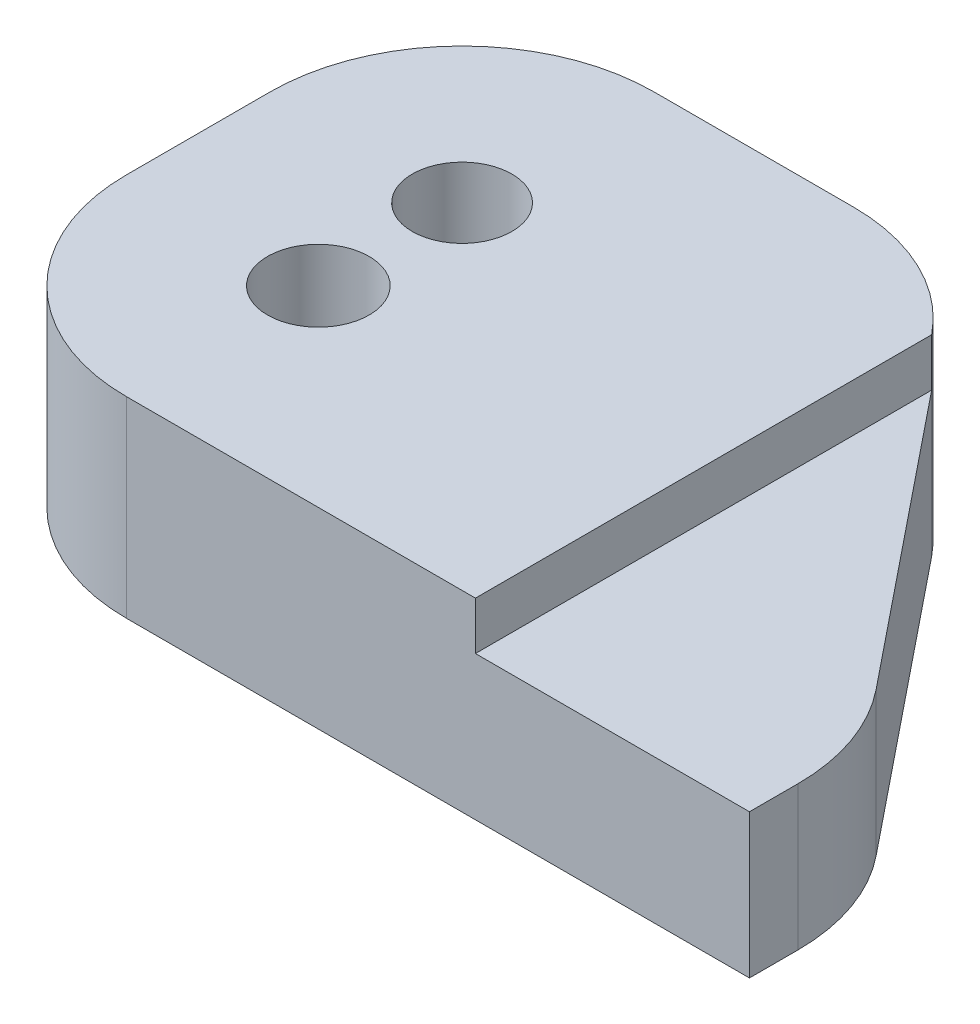
ISO-10303-21;
HEADER;
FILE_DESCRIPTION(('STEP AP214'),'2;1');
FILE_NAME('part.step','',(''),(''),'','','');
FILE_SCHEMA(('AUTOMOTIVE_DESIGN { 1 0 10303 214 1 1 1 1 }'));
ENDSEC;
DATA;
#1=APPLICATION_CONTEXT('core data for automotive mechanical design processes');
#2=APPLICATION_PROTOCOL_DEFINITION('international standard','automotive_design',2000,#1);
#3=PRODUCT_CONTEXT('',#1,'mechanical');
#4=PRODUCT('Part','Part','',(#3));
#5=PRODUCT_RELATED_PRODUCT_CATEGORY('part','',(#4));
#6=PRODUCT_DEFINITION_FORMATION('','',#4);
#7=PRODUCT_DEFINITION_CONTEXT('part definition',#1,'design');
#8=PRODUCT_DEFINITION('design','',#6,#7);
#9=PRODUCT_DEFINITION_SHAPE('','',#8);
#10=(LENGTH_UNIT() NAMED_UNIT(*) SI_UNIT(.MILLI.,.METRE.));
#11=(NAMED_UNIT(*) PLANE_ANGLE_UNIT() SI_UNIT($,.RADIAN.));
#12=(NAMED_UNIT(*) SI_UNIT($,.STERADIAN.) SOLID_ANGLE_UNIT());
#13=UNCERTAINTY_MEASURE_WITH_UNIT(LENGTH_MEASURE(1.E-05),#10,'distance_accuracy_value','');
#14=(GEOMETRIC_REPRESENTATION_CONTEXT(3) GLOBAL_UNCERTAINTY_ASSIGNED_CONTEXT((#13)) GLOBAL_UNIT_ASSIGNED_CONTEXT((#10,
#11,#12)) REPRESENTATION_CONTEXT('',''));
#15=CARTESIAN_POINT('',(0.,0.,0.));
#16=DIRECTION('',(0.,0.,1.));
#17=DIRECTION('',(1.,0.,0.));
#18=AXIS2_PLACEMENT_3D('',#15,#16,#17);
#19=CARTESIAN_POINT('',(0.,19.05,0.));
#20=DIRECTION('',(0.,-1.,0.));
#21=DIRECTION('',(0.,0.,-1.));
#22=AXIS2_PLACEMENT_3D('',#19,#20,#21);
#23=PLANE('',#22);
#24=DIRECTION('',(0.,0.,-1.));
#25=VECTOR('',#24,1.);
#26=CARTESIAN_POINT('',(17.6653326935779,19.05,-25.4528034593956));
#27=LINE('',#26,#25);
#28=CARTESIAN_POINT('',(17.6653326935779,19.05,34.907603773285));
#29=VERTEX_POINT('',#28);
#30=CARTESIAN_POINT('',(17.6653326935779,19.05,-25.4528034593956));
#31=VERTEX_POINT('',#30);
#32=EDGE_CURVE('E56',#29,#31,#27,.T.);
#33=ORIENTED_EDGE('',*,*,#32,.F.);
#34=DIRECTION('',(1.,0.,0.));
#35=VECTOR('',#34,1.);
#36=CARTESIAN_POINT('',(-53.9178925812483,19.05,34.907603773285));
#37=LINE('',#36,#35);
#38=CARTESIAN_POINT('',(53.9178925812483,19.05,34.907603773285));
#39=VERTEX_POINT('',#38);
#40=EDGE_CURVE('E217',#29,#39,#37,.T.);
#41=ORIENTED_EDGE('',*,*,#40,.T.);
#42=DIRECTION('',(0.,0.,-1.));
#43=VECTOR('',#42,1.);
#44=CARTESIAN_POINT('',(53.9178925812483,19.05,34.907603773285));
#45=LINE('',#44,#43);
#46=CARTESIAN_POINT('',(53.9178925812483,19.05,28.4650504511518));
#47=VERTEX_POINT('',#46);
#48=EDGE_CURVE('E221',#39,#47,#45,.T.);
#49=ORIENTED_EDGE('',*,*,#48,.T.);
#50=CARTESIAN_POINT('',(28.5178925812483,19.05,28.4650504511518));
#51=DIRECTION('',(0.,-1.,0.));
#52=DIRECTION('',(0.,0.,-1.));
#53=AXIS2_PLACEMENT_3D('',#50,#51,#52);
#54=CIRCLE('',#53,25.4);
#55=CARTESIAN_POINT('',(48.2893519854011,19.05,12.5198507650412));
#56=VERTEX_POINT('',#55);
#57=EDGE_CURVE('E62',#47,#56,#54,.F.);
#58=ORIENTED_EDGE('',*,*,#57,.T.);
#59=DIRECTION('',(-0.627763767169705,0.,-0.778403913549322));
#60=VECTOR('',#59,1.);
#61=CARTESIAN_POINT('',(10.0402668896038,19.05,-34.907603773285));
#62=LINE('',#61,#60);
#63=EDGE_CURVE('E198',#56,#31,#62,.T.);
#64=ORIENTED_EDGE('',*,*,#63,.T.);
#65=EDGE_LOOP('',(#33,#41,#49,#58,#64));
#66=FACE_BOUND('',#65,.T.);
#67=ADVANCED_FACE('F41',(#66),#23,.F.);
#68=CARTESIAN_POINT('',(-53.9178925812483,19.05,34.907603773285));
#69=DIRECTION('',(1.,0.,0.));
#70=DIRECTION('',(0.,0.,-1.));
#71=AXIS2_PLACEMENT_3D('',#68,#69,#70);
#72=PLANE('',#71);
#73=DIRECTION('',(0.,0.,1.));
#74=VECTOR('',#73,1.);
#75=CARTESIAN_POINT('',(-53.9178925812483,0.,34.907603773285));
#76=LINE('',#75,#74);
#77=CARTESIAN_POINT('',(-53.9178925812483,0.,-9.50760377328504));
#78=VERTEX_POINT('',#77);
#79=CARTESIAN_POINT('',(-53.9178925812483,0.,9.50760377328504));
#80=VERTEX_POINT('',#79);
#81=EDGE_CURVE('E215',#78,#80,#76,.T.);
#82=ORIENTED_EDGE('',*,*,#81,.T.);
#83=DIRECTION('',(0.,-1.,0.));
#84=VECTOR('',#83,1.);
#85=CARTESIAN_POINT('',(-53.9178925812483,19.05,9.50760377328504));
#86=LINE('',#85,#84);
#87=CARTESIAN_POINT('',(-53.9178925812483,25.4,9.50760377328504));
#88=VERTEX_POINT('',#87);
#89=EDGE_CURVE('E130',#80,#88,#86,.F.);
#90=ORIENTED_EDGE('',*,*,#89,.T.);
#91=DIRECTION('',(0.,0.,1.));
#92=VECTOR('',#91,1.);
#93=CARTESIAN_POINT('',(-53.9178925812483,25.4,-9.50760377328504));
#94=LINE('',#93,#92);
#95=CARTESIAN_POINT('',(-53.9178925812483,25.4,-9.50760377328504));
#96=VERTEX_POINT('',#95);
#97=EDGE_CURVE('E134',#96,#88,#94,.T.);
#98=ORIENTED_EDGE('',*,*,#97,.F.);
#99=DIRECTION('',(0.,-1.,0.));
#100=VECTOR('',#99,1.);
#101=CARTESIAN_POINT('',(-53.9178925812483,19.05,-9.50760377328504));
#102=LINE('',#101,#100);
#103=EDGE_CURVE('E120',#96,#78,#102,.T.);
#104=ORIENTED_EDGE('',*,*,#103,.T.);
#105=EDGE_LOOP('',(#82,#90,#98,#104));
#106=FACE_BOUND('',#105,.T.);
#107=ADVANCED_FACE('F135',(#106),#72,.F.);
#108=CARTESIAN_POINT('',(-53.9178925812483,19.05,34.907603773285));
#109=DIRECTION('',(0.,0.,-1.));
#110=DIRECTION('',(-1.,0.,0.));
#111=AXIS2_PLACEMENT_3D('',#108,#109,#110);
#112=PLANE('',#111);
#113=ORIENTED_EDGE('',*,*,#40,.F.);
#114=DIRECTION('',(0.,-1.,0.));
#115=VECTOR('',#114,1.);
#116=CARTESIAN_POINT('',(17.6653326935779,25.4,34.907603773285));
#117=LINE('',#116,#115);
#118=CARTESIAN_POINT('',(17.6653326935779,25.4,34.907603773285));
#119=VERTEX_POINT('',#118);
#120=EDGE_CURVE('E212',#119,#29,#117,.T.);
#121=ORIENTED_EDGE('',*,*,#120,.F.);
#122=DIRECTION('',(1.,0.,0.));
#123=VECTOR('',#122,1.);
#124=CARTESIAN_POINT('',(-28.5178925812483,25.4,34.907603773285));
#125=LINE('',#124,#123);
#126=CARTESIAN_POINT('',(-28.5178925812483,25.4,34.907603773285));
#127=VERTEX_POINT('',#126);
#128=EDGE_CURVE('E166',#127,#119,#125,.T.);
#129=ORIENTED_EDGE('',*,*,#128,.F.);
#130=DIRECTION('',(0.,-1.,0.));
#131=VECTOR('',#130,1.);
#132=CARTESIAN_POINT('',(-28.5178925812483,19.05,34.907603773285));
#133=LINE('',#132,#131);
#134=CARTESIAN_POINT('',(-28.5178925812483,0.,34.907603773285));
#135=VERTEX_POINT('',#134);
#136=EDGE_CURVE('E237',#127,#135,#133,.T.);
#137=ORIENTED_EDGE('',*,*,#136,.T.);
#138=DIRECTION('',(1.,0.,0.));
#139=VECTOR('',#138,1.);
#140=CARTESIAN_POINT('',(-53.9178925812483,0.,34.907603773285));
#141=LINE('',#140,#139);
#142=CARTESIAN_POINT('',(53.9178925812483,0.,34.907603773285));
#143=VERTEX_POINT('',#142);
#144=EDGE_CURVE('E227',#135,#143,#141,.T.);
#145=ORIENTED_EDGE('',*,*,#144,.T.);
#146=DIRECTION('',(0.,-1.,0.));
#147=VECTOR('',#146,1.);
#148=CARTESIAN_POINT('',(53.9178925812483,19.05,34.907603773285));
#149=LINE('',#148,#147);
#150=EDGE_CURVE('E225',#39,#143,#149,.T.);
#151=ORIENTED_EDGE('',*,*,#150,.F.);
#152=EDGE_LOOP('',(#113,#121,#129,#137,#145,#151));
#153=FACE_BOUND('',#152,.T.);
#154=ADVANCED_FACE('F253',(#153),#112,.F.);
#155=CARTESIAN_POINT('',(53.9178925812483,19.05,34.907603773285));
#156=DIRECTION('',(-1.,0.,0.));
#157=DIRECTION('',(0.,0.,1.));
#158=AXIS2_PLACEMENT_3D('',#155,#156,#157);
#159=PLANE('',#158);
#160=DIRECTION('',(0.,0.,-1.));
#161=VECTOR('',#160,1.);
#162=CARTESIAN_POINT('',(53.9178925812483,0.,34.907603773285));
#163=LINE('',#162,#161);
#164=CARTESIAN_POINT('',(53.9178925812483,0.,28.4650504511518));
#165=VERTEX_POINT('',#164);
#166=EDGE_CURVE('E229',#143,#165,#163,.T.);
#167=ORIENTED_EDGE('',*,*,#166,.T.);
#168=DIRECTION('',(0.,-1.,0.));
#169=VECTOR('',#168,1.);
#170=CARTESIAN_POINT('',(53.9178925812483,19.05,28.4650504511518));
#171=LINE('',#170,#169);
#172=EDGE_CURVE('E12',#165,#47,#171,.F.);
#173=ORIENTED_EDGE('',*,*,#172,.T.);
#174=ORIENTED_EDGE('',*,*,#48,.F.);
#175=ORIENTED_EDGE('',*,*,#150,.T.);
#176=EDGE_LOOP('',(#167,#173,#174,#175));
#177=FACE_BOUND('',#176,.T.);
#178=ADVANCED_FACE('F261',(#177),#159,.F.);
#179=CARTESIAN_POINT('',(10.0402668896038,19.05,-34.907603773285));
#180=DIRECTION('',(-0.778403913549322,0.,0.627763767169705));
#181=DIRECTION('',(0.627763767169705,0.,0.778403913549322));
#182=AXIS2_PLACEMENT_3D('',#179,#180,#181);
#183=PLANE('',#182);
#184=DIRECTION('',(-0.627763767169705,0.,-0.778403913549322));
#185=VECTOR('',#184,1.);
#186=CARTESIAN_POINT('',(10.0402668896038,0.,-34.907603773285));
#187=LINE('',#186,#185);
#188=CARTESIAN_POINT('',(48.2893519854011,0.,12.5198507650412));
#189=VERTEX_POINT('',#188);
#190=CARTESIAN_POINT('',(17.6653326935779,0.,-25.4528034593956));
#191=VERTEX_POINT('',#190);
#192=EDGE_CURVE('E201',#189,#191,#187,.T.);
#193=ORIENTED_EDGE('',*,*,#192,.T.);
#194=DIRECTION('',(0.,-1.,0.));
#195=VECTOR('',#194,1.);
#196=CARTESIAN_POINT('',(17.6653326935779,19.05,-25.4528034593956));
#197=LINE('',#196,#195);
#198=EDGE_CURVE('E49',#191,#31,#197,.F.);
#199=ORIENTED_EDGE('',*,*,#198,.T.);
#200=ORIENTED_EDGE('',*,*,#63,.F.);
#201=DIRECTION('',(0.,-1.,0.));
#202=VECTOR('',#201,1.);
#203=CARTESIAN_POINT('',(48.2893519854011,19.05,12.5198507650412));
#204=LINE('',#203,#202);
#205=EDGE_CURVE('E191',#56,#189,#204,.T.);
#206=ORIENTED_EDGE('',*,*,#205,.T.);
#207=EDGE_LOOP('',(#193,#199,#200,#206));
#208=FACE_BOUND('',#207,.T.);
#209=ADVANCED_FACE('F197',(#208),#183,.F.);
#210=CARTESIAN_POINT('',(-53.9178925812483,19.05,-34.907603773285));
#211=DIRECTION('',(0.,0.,1.));
#212=DIRECTION('',(1.,0.,0.));
#213=AXIS2_PLACEMENT_3D('',#210,#211,#212);
#214=PLANE('',#213);
#215=DIRECTION('',(-1.,0.,0.));
#216=VECTOR('',#215,1.);
#217=CARTESIAN_POINT('',(-53.9178925812483,0.,-34.907603773285));
#218=LINE('',#217,#216);
#219=CARTESIAN_POINT('',(-2.10612671057486,0.,-34.907603773285));
#220=VERTEX_POINT('',#219);
#221=CARTESIAN_POINT('',(-28.5178925812483,0.,-34.907603773285));
#222=VERTEX_POINT('',#221);
#223=EDGE_CURVE('E222',#220,#222,#218,.T.);
#224=ORIENTED_EDGE('',*,*,#223,.T.);
#225=DIRECTION('',(0.,-1.,0.));
#226=VECTOR('',#225,1.);
#227=CARTESIAN_POINT('',(-28.5178925812483,19.05,-34.907603773285));
#228=LINE('',#227,#226);
#229=CARTESIAN_POINT('',(-28.5178925812483,25.4,-34.907603773285));
#230=VERTEX_POINT('',#229);
#231=EDGE_CURVE('E188',#222,#230,#228,.F.);
#232=ORIENTED_EDGE('',*,*,#231,.T.);
#233=DIRECTION('',(-1.,0.,0.));
#234=VECTOR('',#233,1.);
#235=CARTESIAN_POINT('',(-2.10612671057485,25.4,-34.907603773285));
#236=LINE('',#235,#234);
#237=CARTESIAN_POINT('',(-2.10612671057485,25.4,-34.907603773285));
#238=VERTEX_POINT('',#237);
#239=EDGE_CURVE('E147',#238,#230,#236,.T.);
#240=ORIENTED_EDGE('',*,*,#239,.F.);
#241=DIRECTION('',(0.,-1.,0.));
#242=VECTOR('',#241,1.);
#243=CARTESIAN_POINT('',(-2.10612671057486,19.05,-34.907603773285));
#244=LINE('',#243,#242);
#245=EDGE_CURVE('E182',#238,#220,#244,.T.);
#246=ORIENTED_EDGE('',*,*,#245,.T.);
#247=EDGE_LOOP('',(#224,#232,#240,#246));
#248=FACE_BOUND('',#247,.T.);
#249=ADVANCED_FACE('F256',(#248),#214,.F.);
#250=CARTESIAN_POINT('',(0.,0.,0.));
#251=DIRECTION('',(0.,-1.,0.));
#252=DIRECTION('',(0.,0.,-1.));
#253=AXIS2_PLACEMENT_3D('',#250,#251,#252);
#254=PLANE('',#253);
#255=CARTESIAN_POINT('',(-28.5178925812483,0.,9.50760377328504));
#256=DIRECTION('',(0.,1.,0.));
#257=DIRECTION('',(0.,0.,1.));
#258=AXIS2_PLACEMENT_3D('',#255,#256,#257);
#259=CIRCLE('',#258,6.72178893281766);
#260=CARTESIAN_POINT('',(-28.5178925812483,0.,16.2293927061027));
#261=VERTEX_POINT('',#260);
#262=EDGE_CURVE('E149',#261,#261,#259,.T.);
#263=ORIENTED_EDGE('',*,*,#262,.T.);
#264=EDGE_LOOP('',(#263));
#265=FACE_BOUND('',#264,.T.);
#266=CARTESIAN_POINT('',(-28.5178925812483,0.,-9.50760377328504));
#267=DIRECTION('',(0.,1.,0.));
#268=DIRECTION('',(0.,0.,1.));
#269=AXIS2_PLACEMENT_3D('',#266,#267,#268);
#270=CIRCLE('',#269,6.5909450769174);
#271=CARTESIAN_POINT('',(-28.5178925812483,0.,-2.91665869636763));
#272=VERTEX_POINT('',#271);
#273=EDGE_CURVE('E353',#272,#272,#270,.T.);
#274=ORIENTED_EDGE('',*,*,#273,.T.);
#275=EDGE_LOOP('',(#274));
#276=FACE_BOUND('',#275,.T.);
#277=ORIENTED_EDGE('',*,*,#144,.F.);
#278=CARTESIAN_POINT('',(-28.5178925812483,0.,9.50760377328504));
#279=DIRECTION('',(0.,-1.,0.));
#280=DIRECTION('',(0.,0.,-1.));
#281=AXIS2_PLACEMENT_3D('',#278,#279,#280);
#282=CIRCLE('',#281,25.4);
#283=EDGE_CURVE('E131',#135,#80,#282,.T.);
#284=ORIENTED_EDGE('',*,*,#283,.T.);
#285=ORIENTED_EDGE('',*,*,#81,.F.);
#286=CARTESIAN_POINT('',(-28.5178925812483,0.,-9.50760377328504));
#287=DIRECTION('',(0.,-1.,0.));
#288=DIRECTION('',(0.,0.,-1.));
#289=AXIS2_PLACEMENT_3D('',#286,#287,#288);
#290=CIRCLE('',#289,25.4);
#291=EDGE_CURVE('E126',#78,#222,#290,.T.);
#292=ORIENTED_EDGE('',*,*,#291,.T.);
#293=ORIENTED_EDGE('',*,*,#223,.F.);
#294=CARTESIAN_POINT('',(-2.10612671057486,0.,-9.50760377328504));
#295=DIRECTION('',(0.,-1.,0.));
#296=DIRECTION('',(0.,0.,-1.));
#297=AXIS2_PLACEMENT_3D('',#294,#295,#296);
#298=CIRCLE('',#297,25.4);
#299=EDGE_CURVE('E242',#220,#191,#298,.T.);
#300=ORIENTED_EDGE('',*,*,#299,.T.);
#301=ORIENTED_EDGE('',*,*,#192,.F.);
#302=CARTESIAN_POINT('',(28.5178925812483,0.,28.4650504511518));
#303=DIRECTION('',(0.,-1.,0.));
#304=DIRECTION('',(0.,0.,-1.));
#305=AXIS2_PLACEMENT_3D('',#302,#303,#304);
#306=CIRCLE('',#305,25.4);
#307=EDGE_CURVE('E240',#189,#165,#306,.T.);
#308=ORIENTED_EDGE('',*,*,#307,.T.);
#309=ORIENTED_EDGE('',*,*,#166,.F.);
#310=EDGE_LOOP('',(#277,#284,#285,#292,#293,#300,#301,#308,#309));
#311=FACE_BOUND('',#310,.T.);
#312=ADVANCED_FACE('F247',(#265,#276,#311),#254,.T.);
#313=CARTESIAN_POINT('',(-28.5178925812483,19.05,9.50760377328504));
#314=DIRECTION('',(0.,-1.,0.));
#315=DIRECTION('',(0.,0.,-1.));
#316=AXIS2_PLACEMENT_3D('',#313,#314,#315);
#317=CYLINDRICAL_SURFACE('',#316,25.4);
#318=ORIENTED_EDGE('',*,*,#136,.F.);
#319=CARTESIAN_POINT('',(-28.5178925812483,25.4,9.50760377328504));
#320=DIRECTION('',(0.,1.,0.));
#321=DIRECTION('',(0.,0.,1.));
#322=AXIS2_PLACEMENT_3D('',#319,#320,#321);
#323=CIRCLE('',#322,25.4);
#324=EDGE_CURVE('E141',#88,#127,#323,.T.);
#325=ORIENTED_EDGE('',*,*,#324,.F.);
#326=ORIENTED_EDGE('',*,*,#89,.F.);
#327=ORIENTED_EDGE('',*,*,#283,.F.);
#328=EDGE_LOOP('',(#318,#325,#326,#327));
#329=FACE_BOUND('',#328,.T.);
#330=ADVANCED_FACE('F250',(#329),#317,.T.);
#331=CARTESIAN_POINT('',(-28.5178925812483,19.05,-9.50760377328504));
#332=DIRECTION('',(0.,-1.,0.));
#333=DIRECTION('',(0.,0.,-1.));
#334=AXIS2_PLACEMENT_3D('',#331,#332,#333);
#335=CYLINDRICAL_SURFACE('',#334,25.4);
#336=ORIENTED_EDGE('',*,*,#103,.F.);
#337=CARTESIAN_POINT('',(-28.5178925812483,25.4,-9.50760377328504));
#338=DIRECTION('',(0.,1.,0.));
#339=DIRECTION('',(0.,0.,1.));
#340=AXIS2_PLACEMENT_3D('',#337,#338,#339);
#341=CIRCLE('',#340,25.4);
#342=EDGE_CURVE('E125',#230,#96,#341,.T.);
#343=ORIENTED_EDGE('',*,*,#342,.F.);
#344=ORIENTED_EDGE('',*,*,#231,.F.);
#345=ORIENTED_EDGE('',*,*,#291,.F.);
#346=EDGE_LOOP('',(#336,#343,#344,#345));
#347=FACE_BOUND('',#346,.T.);
#348=ADVANCED_FACE('F122',(#347),#335,.T.);
#349=CARTESIAN_POINT('',(-2.10612671057486,19.05,-9.50760377328504));
#350=DIRECTION('',(0.,-1.,0.));
#351=DIRECTION('',(0.,0.,-1.));
#352=AXIS2_PLACEMENT_3D('',#349,#350,#351);
#353=CYLINDRICAL_SURFACE('',#352,25.4);
#354=ORIENTED_EDGE('',*,*,#245,.F.);
#355=CARTESIAN_POINT('',(-2.10612671057486,25.4,-9.50760377328504));
#356=DIRECTION('',(0.,1.,0.));
#357=DIRECTION('',(0.,0.,1.));
#358=AXIS2_PLACEMENT_3D('',#355,#356,#357);
#359=CIRCLE('',#358,25.4);
#360=CARTESIAN_POINT('',(17.6653326935779,25.4,-25.4528034593956));
#361=VERTEX_POINT('',#360);
#362=EDGE_CURVE('E174',#361,#238,#359,.T.);
#363=ORIENTED_EDGE('',*,*,#362,.F.);
#364=DIRECTION('',(0.,-1.,0.));
#365=VECTOR('',#364,1.);
#366=CARTESIAN_POINT('',(17.6653326935779,25.4,-25.4528034593956));
#367=LINE('',#366,#365);
#368=EDGE_CURVE('E209',#361,#31,#367,.T.);
#369=ORIENTED_EDGE('',*,*,#368,.T.);
#370=ORIENTED_EDGE('',*,*,#198,.F.);
#371=ORIENTED_EDGE('',*,*,#299,.F.);
#372=EDGE_LOOP('',(#354,#363,#369,#370,#371));
#373=FACE_BOUND('',#372,.T.);
#374=ADVANCED_FACE('F213',(#373),#353,.T.);
#375=CARTESIAN_POINT('',(28.5178925812483,19.05,28.4650504511518));
#376=DIRECTION('',(0.,-1.,0.));
#377=DIRECTION('',(0.,0.,-1.));
#378=AXIS2_PLACEMENT_3D('',#375,#376,#377);
#379=CYLINDRICAL_SURFACE('',#378,25.4);
#380=ORIENTED_EDGE('',*,*,#57,.F.);
#381=ORIENTED_EDGE('',*,*,#172,.F.);
#382=ORIENTED_EDGE('',*,*,#307,.F.);
#383=ORIENTED_EDGE('',*,*,#205,.F.);
#384=EDGE_LOOP('',(#380,#381,#382,#383));
#385=FACE_BOUND('',#384,.T.);
#386=ADVANCED_FACE('F43',(#385),#379,.T.);
#387=CARTESIAN_POINT('',(17.6653326935779,25.4,-25.4528034593956));
#388=DIRECTION('',(-1.,0.,0.));
#389=DIRECTION('',(0.,0.,1.));
#390=AXIS2_PLACEMENT_3D('',#387,#388,#389);
#391=PLANE('',#390);
#392=ORIENTED_EDGE('',*,*,#32,.T.);
#393=ORIENTED_EDGE('',*,*,#368,.F.);
#394=DIRECTION('',(0.,0.,-1.));
#395=VECTOR('',#394,1.);
#396=CARTESIAN_POINT('',(17.6653326935779,25.4,-25.4528034593956));
#397=LINE('',#396,#395);
#398=EDGE_CURVE('E170',#119,#361,#397,.T.);
#399=ORIENTED_EDGE('',*,*,#398,.F.);
#400=ORIENTED_EDGE('',*,*,#120,.T.);
#401=EDGE_LOOP('',(#392,#393,#399,#400));
#402=FACE_BOUND('',#401,.T.);
#403=ADVANCED_FACE('F207',(#402),#391,.F.);
#404=CARTESIAN_POINT('',(-28.5178925812483,25.4,-9.50760377328504));
#405=DIRECTION('',(0.,1.,0.));
#406=DIRECTION('',(0.,0.,1.));
#407=AXIS2_PLACEMENT_3D('',#404,#405,#406);
#408=PLANE('',#407);
#409=CARTESIAN_POINT('',(-28.5178925812483,25.4,9.50760377328504));
#410=DIRECTION('',(0.,1.,0.));
#411=DIRECTION('',(0.,0.,1.));
#412=AXIS2_PLACEMENT_3D('',#409,#410,#411);
#413=CIRCLE('',#412,6.72178893281766);
#414=CARTESIAN_POINT('',(-28.5178925812483,25.4,16.2293927061027));
#415=VERTEX_POINT('',#414);
#416=EDGE_CURVE('E352',#415,#415,#413,.T.);
#417=ORIENTED_EDGE('',*,*,#416,.F.);
#418=EDGE_LOOP('',(#417));
#419=FACE_BOUND('',#418,.T.);
#420=CARTESIAN_POINT('',(-28.5178925812483,25.4,-9.50760377328504));
#421=DIRECTION('',(0.,1.,0.));
#422=DIRECTION('',(0.,0.,1.));
#423=AXIS2_PLACEMENT_3D('',#420,#421,#422);
#424=CIRCLE('',#423,6.5909450769174);
#425=CARTESIAN_POINT('',(-28.5178925812483,25.4,-2.91665869636763));
#426=VERTEX_POINT('',#425);
#427=EDGE_CURVE('E153',#426,#426,#424,.T.);
#428=ORIENTED_EDGE('',*,*,#427,.F.);
#429=EDGE_LOOP('',(#428));
#430=FACE_BOUND('',#429,.T.);
#431=ORIENTED_EDGE('',*,*,#342,.T.);
#432=ORIENTED_EDGE('',*,*,#97,.T.);
#433=ORIENTED_EDGE('',*,*,#324,.T.);
#434=ORIENTED_EDGE('',*,*,#128,.T.);
#435=ORIENTED_EDGE('',*,*,#398,.T.);
#436=ORIENTED_EDGE('',*,*,#362,.T.);
#437=ORIENTED_EDGE('',*,*,#239,.T.);
#438=EDGE_LOOP('',(#431,#432,#433,#434,#435,#436,#437));
#439=FACE_BOUND('',#438,.T.);
#440=ADVANCED_FACE('F144',(#419,#430,#439),#408,.T.);
#441=CARTESIAN_POINT('',(-28.5178925812483,0.,-9.50760377328504));
#442=DIRECTION('',(0.,1.,0.));
#443=DIRECTION('',(0.,0.,1.));
#444=AXIS2_PLACEMENT_3D('',#441,#442,#443);
#445=CYLINDRICAL_SURFACE('',#444,6.5909450769174);
#446=ORIENTED_EDGE('',*,*,#273,.F.);
#447=EDGE_LOOP('',(#446));
#448=FACE_BOUND('',#447,.T.);
#449=ORIENTED_EDGE('',*,*,#427,.T.);
#450=EDGE_LOOP('',(#449));
#451=FACE_BOUND('',#450,.T.);
#452=ADVANCED_FACE('F324',(#448,#451),#445,.F.);
#453=CARTESIAN_POINT('',(-28.5178925812483,0.,9.50760377328504));
#454=DIRECTION('',(0.,1.,0.));
#455=DIRECTION('',(0.,0.,1.));
#456=AXIS2_PLACEMENT_3D('',#453,#454,#455);
#457=CYLINDRICAL_SURFACE('',#456,6.72178893281766);
#458=ORIENTED_EDGE('',*,*,#262,.F.);
#459=EDGE_LOOP('',(#458));
#460=FACE_BOUND('',#459,.T.);
#461=ORIENTED_EDGE('',*,*,#416,.T.);
#462=EDGE_LOOP('',(#461));
#463=FACE_BOUND('',#462,.T.);
#464=ADVANCED_FACE('F333',(#460,#463),#457,.F.);
#465=CLOSED_SHELL('',(#67,#107,#154,#178,#209,#249,#312,#330,#348,#374,#386,#403,#440,#452,#464));
#466=MANIFOLD_SOLID_BREP('B2',#465);
#467=ADVANCED_BREP_SHAPE_REPRESENTATION('',(#18,#466),#14);
#468=SHAPE_DEFINITION_REPRESENTATION(#9,#467);
ENDSEC;
END-ISO-10303-21;
